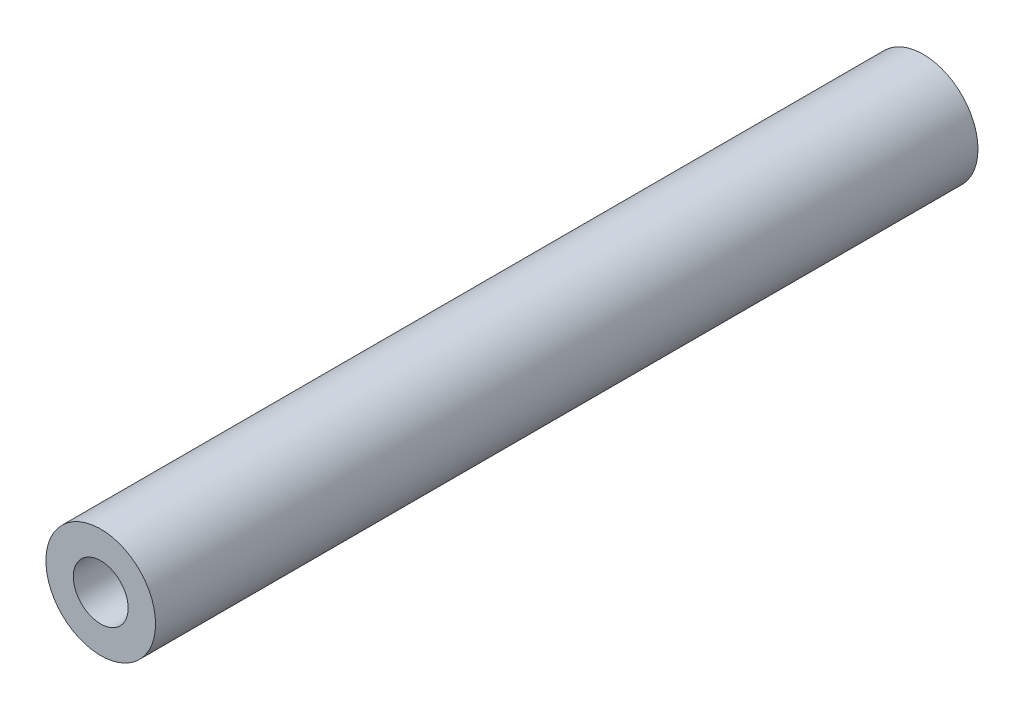
ISO-10303-21;
HEADER;
FILE_DESCRIPTION(('STEP AP214'),'2;1');
FILE_NAME('part.step','',(''),(''),'','','');
FILE_SCHEMA(('AUTOMOTIVE_DESIGN { 1 0 10303 214 1 1 1 1 }'));
ENDSEC;
DATA;
#1=APPLICATION_CONTEXT('core data for automotive mechanical design processes');
#2=APPLICATION_PROTOCOL_DEFINITION('international standard','automotive_design',2000,#1);
#3=PRODUCT_CONTEXT('',#1,'mechanical');
#4=PRODUCT('Part','Part','',(#3));
#5=PRODUCT_RELATED_PRODUCT_CATEGORY('part','',(#4));
#6=PRODUCT_DEFINITION_FORMATION('','',#4);
#7=PRODUCT_DEFINITION_CONTEXT('part definition',#1,'design');
#8=PRODUCT_DEFINITION('design','',#6,#7);
#9=PRODUCT_DEFINITION_SHAPE('','',#8);
#10=(LENGTH_UNIT() NAMED_UNIT(*) SI_UNIT(.MILLI.,.METRE.));
#11=(NAMED_UNIT(*) PLANE_ANGLE_UNIT() SI_UNIT($,.RADIAN.));
#12=(NAMED_UNIT(*) SI_UNIT($,.STERADIAN.) SOLID_ANGLE_UNIT());
#13=UNCERTAINTY_MEASURE_WITH_UNIT(LENGTH_MEASURE(1.E-05),#10,'distance_accuracy_value','');
#14=(GEOMETRIC_REPRESENTATION_CONTEXT(3) GLOBAL_UNCERTAINTY_ASSIGNED_CONTEXT((#13)) GLOBAL_UNIT_ASSIGNED_CONTEXT((#10,
#11,#12)) REPRESENTATION_CONTEXT('',''));
#15=CARTESIAN_POINT('',(0.,0.,0.));
#16=DIRECTION('',(0.,0.,1.));
#17=DIRECTION('',(1.,0.,0.));
#18=AXIS2_PLACEMENT_3D('',#15,#16,#17);
#19=CARTESIAN_POINT('',(0.,0.,45.));
#20=DIRECTION('',(0.,0.,1.));
#21=DIRECTION('',(1.,0.,0.));
#22=AXIS2_PLACEMENT_3D('',#19,#20,#21);
#23=PLANE('',#22);
#24=CARTESIAN_POINT('',(0.,0.,45.));
#25=DIRECTION('',(0.,0.,1.));
#26=DIRECTION('',(1.,0.,0.));
#27=AXIS2_PLACEMENT_3D('',#24,#25,#26);
#28=CIRCLE('',#27,3.);
#29=CARTESIAN_POINT('',(3.,0.,45.));
#30=VERTEX_POINT('',#29);
#31=EDGE_CURVE('E10',#30,#30,#28,.T.);
#32=ORIENTED_EDGE('',*,*,#31,.T.);
#33=EDGE_LOOP('',(#32));
#34=FACE_BOUND('',#33,.T.);
#35=CARTESIAN_POINT('',(0.,0.,45.));
#36=DIRECTION('',(0.,0.,1.));
#37=DIRECTION('',(1.,0.,0.));
#38=AXIS2_PLACEMENT_3D('',#35,#36,#37);
#39=CIRCLE('',#38,1.5);
#40=CARTESIAN_POINT('',(1.5,0.,45.));
#41=VERTEX_POINT('',#40);
#42=EDGE_CURVE('E41',#41,#41,#39,.T.);
#43=ORIENTED_EDGE('',*,*,#42,.F.);
#44=EDGE_LOOP('',(#43));
#45=FACE_BOUND('',#44,.T.);
#46=ADVANCED_FACE('F30',(#34,#45),#23,.T.);
#47=CARTESIAN_POINT('',(0.,0.,0.));
#48=DIRECTION('',(0.,0.,1.));
#49=DIRECTION('',(1.,0.,0.));
#50=AXIS2_PLACEMENT_3D('',#47,#48,#49);
#51=PLANE('',#50);
#52=CARTESIAN_POINT('',(0.,0.,0.));
#53=DIRECTION('',(0.,0.,1.));
#54=DIRECTION('',(1.,0.,0.));
#55=AXIS2_PLACEMENT_3D('',#52,#53,#54);
#56=CIRCLE('',#55,3.);
#57=CARTESIAN_POINT('',(3.,0.,0.));
#58=VERTEX_POINT('',#57);
#59=EDGE_CURVE('E34',#58,#58,#56,.T.);
#60=ORIENTED_EDGE('',*,*,#59,.F.);
#61=EDGE_LOOP('',(#60));
#62=FACE_BOUND('',#61,.T.);
#63=CARTESIAN_POINT('',(0.,0.,0.));
#64=DIRECTION('',(0.,0.,1.));
#65=DIRECTION('',(1.,0.,0.));
#66=AXIS2_PLACEMENT_3D('',#63,#64,#65);
#67=CIRCLE('',#66,1.5);
#68=CARTESIAN_POINT('',(1.5,0.,0.));
#69=VERTEX_POINT('',#68);
#70=EDGE_CURVE('E43',#69,#69,#67,.T.);
#71=ORIENTED_EDGE('',*,*,#70,.T.);
#72=EDGE_LOOP('',(#71));
#73=FACE_BOUND('',#72,.T.);
#74=ADVANCED_FACE('F53',(#62,#73),#51,.F.);
#75=CARTESIAN_POINT('',(0.,0.,45.));
#76=DIRECTION('',(0.,0.,-1.));
#77=DIRECTION('',(-1.,0.,0.));
#78=AXIS2_PLACEMENT_3D('',#75,#76,#77);
#79=CYLINDRICAL_SURFACE('',#78,3.);
#80=ORIENTED_EDGE('',*,*,#31,.F.);
#81=EDGE_LOOP('',(#80));
#82=FACE_BOUND('',#81,.T.);
#83=ORIENTED_EDGE('',*,*,#59,.T.);
#84=EDGE_LOOP('',(#83));
#85=FACE_BOUND('',#84,.T.);
#86=ADVANCED_FACE('F32',(#82,#85),#79,.T.);
#87=CARTESIAN_POINT('',(0.,0.,45.));
#88=DIRECTION('',(0.,0.,-1.));
#89=DIRECTION('',(-1.,0.,0.));
#90=AXIS2_PLACEMENT_3D('',#87,#88,#89);
#91=CYLINDRICAL_SURFACE('',#90,1.5);
#92=ORIENTED_EDGE('',*,*,#42,.T.);
#93=EDGE_LOOP('',(#92));
#94=FACE_BOUND('',#93,.T.);
#95=ORIENTED_EDGE('',*,*,#70,.F.);
#96=EDGE_LOOP('',(#95));
#97=FACE_BOUND('',#96,.T.);
#98=ADVANCED_FACE('F49',(#94,#97),#91,.F.);
#99=CLOSED_SHELL('',(#46,#74,#86,#98));
#100=MANIFOLD_SOLID_BREP('B2',#99);
#101=ADVANCED_BREP_SHAPE_REPRESENTATION('',(#18,#100),#14);
#102=SHAPE_DEFINITION_REPRESENTATION(#9,#101);
ENDSEC;
END-ISO-10303-21;
